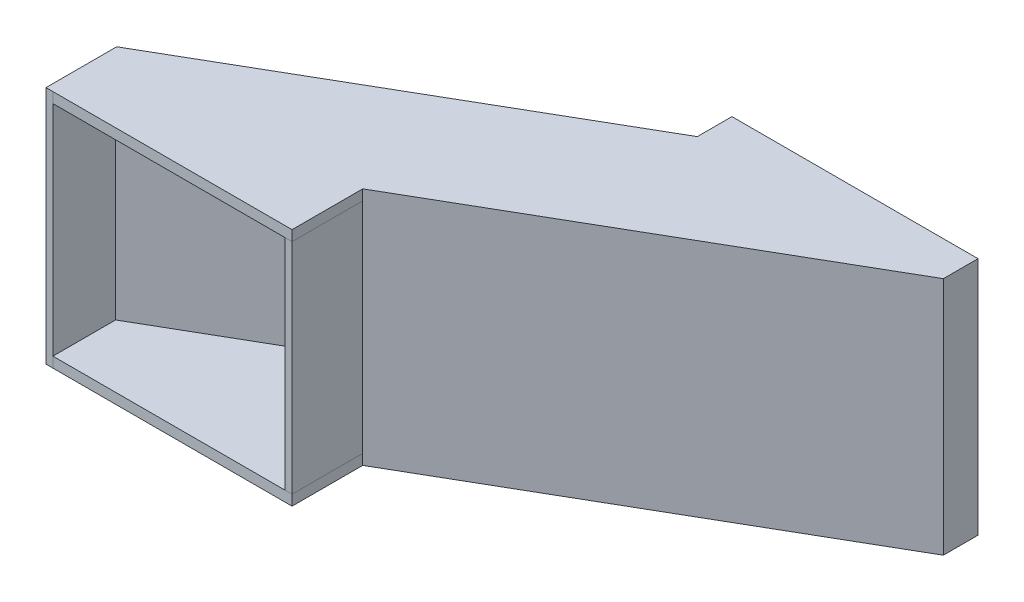
ISO-10303-21;
HEADER;
FILE_DESCRIPTION(('STEP AP214'),'2;1');
FILE_NAME('part.step','',(''),(''),'','','');
FILE_SCHEMA(('AUTOMOTIVE_DESIGN { 1 0 10303 214 1 1 1 1 }'));
ENDSEC;
DATA;
#1=APPLICATION_CONTEXT('core data for automotive mechanical design processes');
#2=APPLICATION_PROTOCOL_DEFINITION('international standard','automotive_design',2000,#1);
#3=PRODUCT_CONTEXT('',#1,'mechanical');
#4=PRODUCT('Part','Part','',(#3));
#5=PRODUCT_RELATED_PRODUCT_CATEGORY('part','',(#4));
#6=PRODUCT_DEFINITION_FORMATION('','',#4);
#7=PRODUCT_DEFINITION_CONTEXT('part definition',#1,'design');
#8=PRODUCT_DEFINITION('design','',#6,#7);
#9=PRODUCT_DEFINITION_SHAPE('','',#8);
#10=(LENGTH_UNIT() NAMED_UNIT(*) SI_UNIT(.MILLI.,.METRE.));
#11=(NAMED_UNIT(*) PLANE_ANGLE_UNIT() SI_UNIT($,.RADIAN.));
#12=(NAMED_UNIT(*) SI_UNIT($,.STERADIAN.) SOLID_ANGLE_UNIT());
#13=UNCERTAINTY_MEASURE_WITH_UNIT(LENGTH_MEASURE(1.E-05),#10,'distance_accuracy_value','');
#14=(GEOMETRIC_REPRESENTATION_CONTEXT(3) GLOBAL_UNCERTAINTY_ASSIGNED_CONTEXT((#13)) GLOBAL_UNIT_ASSIGNED_CONTEXT((#10,
#11,#12)) REPRESENTATION_CONTEXT('',''));
#15=CARTESIAN_POINT('',(0.,0.,0.));
#16=DIRECTION('',(0.,0.,1.));
#17=DIRECTION('',(1.,0.,0.));
#18=AXIS2_PLACEMENT_3D('',#15,#16,#17);
#19=CARTESIAN_POINT('',(-139.815929778168,34.5799191610907,91.7730554654798));
#20=DIRECTION('',(0.,1.,0.));
#21=DIRECTION('',(-1.,0.,0.));
#22=AXIS2_PLACEMENT_3D('',#19,#20,#21);
#23=PLANE('',#22);
#24=DIRECTION('',(9.88342315044595E-06,0.,-0.999999999951159));
#25=VECTOR('',#24,1.);
#26=CARTESIAN_POINT('',(-141.81592977807,34.5799191610907,91.7730356986335));
#27=LINE('',#26,#25);
#28=CARTESIAN_POINT('',(-141.81592977807,34.5799191610907,91.7730356986335));
#29=VERTEX_POINT('',#28);
#30=CARTESIAN_POINT('',(-141.815728098693,34.5799191610907,71.3672133594261));
#31=VERTEX_POINT('',#30);
#32=EDGE_CURVE('E112',#29,#31,#27,.T.);
#33=ORIENTED_EDGE('',*,*,#32,.F.);
#34=DIRECTION('',(-0.999999999951159,0.,-9.88342315044596E-06));
#35=VECTOR('',#34,1.);
#36=CARTESIAN_POINT('',(-139.815929778168,34.5799191610907,91.7730554654798));
#37=LINE('',#36,#35);
#38=CARTESIAN_POINT('',(-139.815929778168,34.5799191610907,91.7730554654798));
#39=VERTEX_POINT('',#38);
#40=EDGE_CURVE('E12',#39,#29,#37,.T.);
#41=ORIENTED_EDGE('',*,*,#40,.F.);
#42=DIRECTION('',(9.88342315044595E-06,0.,-0.999999999951159));
#43=VECTOR('',#42,1.);
#44=CARTESIAN_POINT('',(-139.815929778168,34.5799191610907,91.7730554654798));
#45=LINE('',#44,#43);
#46=CARTESIAN_POINT('',(-139.815728098791,34.5799191610907,71.3672331262724));
#47=VERTEX_POINT('',#46);
#48=EDGE_CURVE('E106',#39,#47,#45,.T.);
#49=ORIENTED_EDGE('',*,*,#48,.T.);
#50=DIRECTION('',(-0.999999999951159,0.,-9.88342315044596E-06));
#51=VECTOR('',#50,1.);
#52=CARTESIAN_POINT('',(-139.815728098791,34.5799191610907,71.3672331262724));
#53=LINE('',#52,#51);
#54=EDGE_CURVE('E51',#47,#31,#53,.T.);
#55=ORIENTED_EDGE('',*,*,#54,.T.);
#56=EDGE_LOOP('',(#33,#41,#49,#55));
#57=FACE_BOUND('',#56,.T.);
#58=ADVANCED_FACE('F48',(#57),#23,.T.);
#59=CARTESIAN_POINT('',(-139.815929778168,-34.5799191610907,91.7730554654798));
#60=DIRECTION('',(-9.88342315044596E-06,0.,0.999999999951159));
#61=DIRECTION('',(0.999999999951159,0.,9.88342315044596E-06));
#62=AXIS2_PLACEMENT_3D('',#59,#60,#61);
#63=PLANE('',#62);
#64=DIRECTION('',(0.,1.,0.));
#65=VECTOR('',#64,1.);
#66=CARTESIAN_POINT('',(-141.81592977807,-34.5799191610907,91.7730356986335));
#67=LINE('',#66,#65);
#68=CARTESIAN_POINT('',(-141.81592977807,-34.5799191610907,91.7730356986335));
#69=VERTEX_POINT('',#68);
#70=EDGE_CURVE('E108',#69,#29,#67,.T.);
#71=ORIENTED_EDGE('',*,*,#70,.F.);
#72=DIRECTION('',(-0.999999999951159,0.,-9.88342315044596E-06));
#73=VECTOR('',#72,1.);
#74=CARTESIAN_POINT('',(-139.815929778168,-34.5799191610907,91.7730554654798));
#75=LINE('',#74,#73);
#76=CARTESIAN_POINT('',(-139.815929778168,-34.5799191610907,91.7730554654798));
#77=VERTEX_POINT('',#76);
#78=EDGE_CURVE('E57',#77,#69,#75,.T.);
#79=ORIENTED_EDGE('',*,*,#78,.F.);
#80=DIRECTION('',(0.,1.,0.));
#81=VECTOR('',#80,1.);
#82=CARTESIAN_POINT('',(-139.815929778168,-34.5799191610907,91.7730554654798));
#83=LINE('',#82,#81);
#84=EDGE_CURVE('E103',#77,#39,#83,.T.);
#85=ORIENTED_EDGE('',*,*,#84,.T.);
#86=ORIENTED_EDGE('',*,*,#40,.T.);
#87=EDGE_LOOP('',(#71,#79,#85,#86));
#88=FACE_BOUND('',#87,.T.);
#89=ADVANCED_FACE('F122',(#88),#63,.T.);
#90=CARTESIAN_POINT('',(-139.815728098791,-34.5799191610907,71.3672331262724));
#91=DIRECTION('',(0.,-1.,0.));
#92=DIRECTION('',(1.,0.,0.));
#93=AXIS2_PLACEMENT_3D('',#90,#91,#92);
#94=PLANE('',#93);
#95=DIRECTION('',(-9.88342315044595E-06,0.,0.999999999951159));
#96=VECTOR('',#95,1.);
#97=CARTESIAN_POINT('',(-141.815728098693,-34.5799191610907,71.3672133594261));
#98=LINE('',#97,#96);
#99=CARTESIAN_POINT('',(-141.815728098693,-34.5799191610907,71.3672133594261));
#100=VERTEX_POINT('',#99);
#101=EDGE_CURVE('E98',#100,#69,#98,.T.);
#102=ORIENTED_EDGE('',*,*,#101,.F.);
#103=DIRECTION('',(-0.999999999951159,0.,-9.88342315044596E-06));
#104=VECTOR('',#103,1.);
#105=CARTESIAN_POINT('',(-139.815728098791,-34.5799191610907,71.3672331262724));
#106=LINE('',#105,#104);
#107=CARTESIAN_POINT('',(-139.815728098791,-34.5799191610907,71.3672331262724));
#108=VERTEX_POINT('',#107);
#109=EDGE_CURVE('E93',#108,#100,#106,.T.);
#110=ORIENTED_EDGE('',*,*,#109,.F.);
#111=DIRECTION('',(-9.88342315044595E-06,0.,0.999999999951159));
#112=VECTOR('',#111,1.);
#113=CARTESIAN_POINT('',(-139.815728098791,-34.5799191610907,71.3672331262724));
#114=LINE('',#113,#112);
#115=EDGE_CURVE('E96',#108,#77,#114,.T.);
#116=ORIENTED_EDGE('',*,*,#115,.T.);
#117=ORIENTED_EDGE('',*,*,#78,.T.);
#118=EDGE_LOOP('',(#102,#110,#116,#117));
#119=FACE_BOUND('',#118,.T.);
#120=ADVANCED_FACE('F95',(#119),#94,.T.);
#121=CARTESIAN_POINT('',(-139.815728098791,34.5799191610907,71.3672331262724));
#122=DIRECTION('',(9.88342315044596E-06,0.,-0.999999999951159));
#123=DIRECTION('',(-0.999999999951159,0.,-9.88342315044596E-06));
#124=AXIS2_PLACEMENT_3D('',#121,#122,#123);
#125=PLANE('',#124);
#126=DIRECTION('',(0.,-1.,0.));
#127=VECTOR('',#126,1.);
#128=CARTESIAN_POINT('',(-141.815728098693,34.5799191610907,71.3672133594261));
#129=LINE('',#128,#127);
#130=EDGE_CURVE('E115',#31,#100,#129,.T.);
#131=ORIENTED_EDGE('',*,*,#130,.F.);
#132=ORIENTED_EDGE('',*,*,#54,.F.);
#133=DIRECTION('',(0.,-1.,0.));
#134=VECTOR('',#133,1.);
#135=CARTESIAN_POINT('',(-139.815728098791,34.5799191610907,71.3672331262724));
#136=LINE('',#135,#134);
#137=EDGE_CURVE('E102',#47,#108,#136,.T.);
#138=ORIENTED_EDGE('',*,*,#137,.T.);
#139=ORIENTED_EDGE('',*,*,#109,.T.);
#140=EDGE_LOOP('',(#131,#132,#138,#139));
#141=FACE_BOUND('',#140,.T.);
#142=ADVANCED_FACE('F105',(#141),#125,.T.);
#143=CARTESIAN_POINT('',(-139.815022732569,0.,-0.00138185103252269));
#144=DIRECTION('',(-0.999999999951159,0.,-9.88342315044595E-06));
#145=DIRECTION('',(-9.88342315044595E-06,0.,0.999999999951159));
#146=AXIS2_PLACEMENT_3D('',#143,#144,#145);
#147=PLANE('',#146);
#148=ORIENTED_EDGE('',*,*,#48,.F.);
#149=ORIENTED_EDGE('',*,*,#84,.F.);
#150=ORIENTED_EDGE('',*,*,#115,.F.);
#151=ORIENTED_EDGE('',*,*,#137,.F.);
#152=EDGE_LOOP('',(#148,#149,#150,#151));
#153=FACE_BOUND('',#152,.T.);
#154=ADVANCED_FACE('F101',(#153),#147,.F.);
#155=CARTESIAN_POINT('',(-141.815022732472,0.,-0.00140161787882359));
#156=DIRECTION('',(-0.999999999951159,0.,-9.88342315044595E-06));
#157=DIRECTION('',(-9.88342315044595E-06,0.,0.999999999951159));
#158=AXIS2_PLACEMENT_3D('',#155,#156,#157);
#159=PLANE('',#158);
#160=ORIENTED_EDGE('',*,*,#32,.T.);
#161=ORIENTED_EDGE('',*,*,#130,.T.);
#162=ORIENTED_EDGE('',*,*,#101,.T.);
#163=ORIENTED_EDGE('',*,*,#70,.T.);
#164=EDGE_LOOP('',(#160,#161,#162,#163));
#165=FACE_BOUND('',#164,.T.);
#166=ADVANCED_FACE('F121',(#165),#159,.T.);
#167=CLOSED_SHELL('',(#58,#89,#120,#142,#154,#166));
#168=MANIFOLD_SOLID_BREP('B2',#167);
#169=CARTESIAN_POINT('',(-72.7659297780701,31.5799191610907,91.7730356986335));
#170=DIRECTION('',(0.,1.,0.));
#171=DIRECTION('',(-1.,0.,0.));
#172=AXIS2_PLACEMENT_3D('',#169,#170,#171);
#173=PLANE('',#172);
#174=DIRECTION('',(0.,0.,1.));
#175=VECTOR('',#174,1.);
#176=CARTESIAN_POINT('',(-70.7659297780701,31.5799191610907,91.7730356986335));
#177=LINE('',#176,#175);
#178=CARTESIAN_POINT('',(-70.7659297780701,31.5799191610907,71.3668640404984));
#179=VERTEX_POINT('',#178);
#180=CARTESIAN_POINT('',(-70.7659297780701,31.5799191610907,91.7730356986335));
#181=VERTEX_POINT('',#180);
#182=EDGE_CURVE('E258',#179,#181,#177,.T.);
#183=ORIENTED_EDGE('',*,*,#182,.F.);
#184=DIRECTION('',(1.,0.,0.));
#185=VECTOR('',#184,1.);
#186=CARTESIAN_POINT('',(-72.7659297780701,31.5799191610907,71.3668640404984));
#187=LINE('',#186,#185);
#188=CARTESIAN_POINT('',(-72.7659297780701,31.5799191610907,71.3668640404984));
#189=VERTEX_POINT('',#188);
#190=EDGE_CURVE('E46',#189,#179,#187,.T.);
#191=ORIENTED_EDGE('',*,*,#190,.F.);
#192=DIRECTION('',(0.,0.,1.));
#193=VECTOR('',#192,1.);
#194=CARTESIAN_POINT('',(-72.7659297780701,31.5799191610907,91.7730356986335));
#195=LINE('',#194,#193);
#196=CARTESIAN_POINT('',(-72.7659297780701,31.5799191610907,91.7730356986335));
#197=VERTEX_POINT('',#196);
#198=EDGE_CURVE('E252',#189,#197,#195,.T.);
#199=ORIENTED_EDGE('',*,*,#198,.T.);
#200=DIRECTION('',(1.,0.,0.));
#201=VECTOR('',#200,1.);
#202=CARTESIAN_POINT('',(-72.7659297780701,31.5799191610907,91.7730356986335));
#203=LINE('',#202,#201);
#204=EDGE_CURVE('E197',#197,#181,#203,.T.);
#205=ORIENTED_EDGE('',*,*,#204,.T.);
#206=EDGE_LOOP('',(#183,#191,#199,#205));
#207=FACE_BOUND('',#206,.T.);
#208=ADVANCED_FACE('F194',(#207),#173,.T.);
#209=CARTESIAN_POINT('',(-72.7659297780701,31.5799191610907,71.3668640404984));
#210=DIRECTION('',(0.,0.,-1.));
#211=DIRECTION('',(-1.,0.,0.));
#212=AXIS2_PLACEMENT_3D('',#209,#210,#211);
#213=PLANE('',#212);
#214=DIRECTION('',(0.,1.,0.));
#215=VECTOR('',#214,1.);
#216=CARTESIAN_POINT('',(-70.7659297780701,31.5799191610907,71.3668640404984));
#217=LINE('',#216,#215);
#218=CARTESIAN_POINT('',(-70.7659297780701,-31.5799191610907,71.3668640404984));
#219=VERTEX_POINT('',#218);
#220=EDGE_CURVE('E254',#219,#179,#217,.T.);
#221=ORIENTED_EDGE('',*,*,#220,.F.);
#222=DIRECTION('',(1.,0.,0.));
#223=VECTOR('',#222,1.);
#224=CARTESIAN_POINT('',(-72.7659297780701,-31.5799191610907,71.3668640404984));
#225=LINE('',#224,#223);
#226=CARTESIAN_POINT('',(-72.7659297780701,-31.5799191610907,71.3668640404984));
#227=VERTEX_POINT('',#226);
#228=EDGE_CURVE('E203',#227,#219,#225,.T.);
#229=ORIENTED_EDGE('',*,*,#228,.F.);
#230=DIRECTION('',(0.,1.,0.));
#231=VECTOR('',#230,1.);
#232=CARTESIAN_POINT('',(-72.7659297780701,31.5799191610907,71.3668640404984));
#233=LINE('',#232,#231);
#234=EDGE_CURVE('E249',#227,#189,#233,.T.);
#235=ORIENTED_EDGE('',*,*,#234,.T.);
#236=ORIENTED_EDGE('',*,*,#190,.T.);
#237=EDGE_LOOP('',(#221,#229,#235,#236));
#238=FACE_BOUND('',#237,.T.);
#239=ADVANCED_FACE('F268',(#238),#213,.T.);
#240=CARTESIAN_POINT('',(-72.7659297780701,-31.5799191610907,91.7730356986335));
#241=DIRECTION('',(0.,-1.,0.));
#242=DIRECTION('',(1.,0.,0.));
#243=AXIS2_PLACEMENT_3D('',#240,#241,#242);
#244=PLANE('',#243);
#245=DIRECTION('',(0.,0.,-1.));
#246=VECTOR('',#245,1.);
#247=CARTESIAN_POINT('',(-70.7659297780701,-31.5799191610907,91.7730356986335));
#248=LINE('',#247,#246);
#249=CARTESIAN_POINT('',(-70.7659297780701,-31.5799191610907,91.7730356986335));
#250=VERTEX_POINT('',#249);
#251=EDGE_CURVE('E244',#250,#219,#248,.T.);
#252=ORIENTED_EDGE('',*,*,#251,.F.);
#253=DIRECTION('',(1.,0.,0.));
#254=VECTOR('',#253,1.);
#255=CARTESIAN_POINT('',(-72.7659297780701,-31.5799191610907,91.7730356986335));
#256=LINE('',#255,#254);
#257=CARTESIAN_POINT('',(-72.7659297780701,-31.5799191610907,91.7730356986335));
#258=VERTEX_POINT('',#257);
#259=EDGE_CURVE('E239',#258,#250,#256,.T.);
#260=ORIENTED_EDGE('',*,*,#259,.F.);
#261=DIRECTION('',(0.,0.,-1.));
#262=VECTOR('',#261,1.);
#263=CARTESIAN_POINT('',(-72.7659297780701,-31.5799191610907,91.7730356986335));
#264=LINE('',#263,#262);
#265=EDGE_CURVE('E242',#258,#227,#264,.T.);
#266=ORIENTED_EDGE('',*,*,#265,.T.);
#267=ORIENTED_EDGE('',*,*,#228,.T.);
#268=EDGE_LOOP('',(#252,#260,#266,#267));
#269=FACE_BOUND('',#268,.T.);
#270=ADVANCED_FACE('F241',(#269),#244,.T.);
#271=CARTESIAN_POINT('',(-72.7659297780701,-31.5799191610907,91.7730356986335));
#272=DIRECTION('',(0.,0.,1.));
#273=DIRECTION('',(1.,0.,0.));
#274=AXIS2_PLACEMENT_3D('',#271,#272,#273);
#275=PLANE('',#274);
#276=DIRECTION('',(0.,-1.,0.));
#277=VECTOR('',#276,1.);
#278=CARTESIAN_POINT('',(-70.7659297780701,-31.5799191610907,91.7730356986335));
#279=LINE('',#278,#277);
#280=EDGE_CURVE('E261',#181,#250,#279,.T.);
#281=ORIENTED_EDGE('',*,*,#280,.F.);
#282=ORIENTED_EDGE('',*,*,#204,.F.);
#283=DIRECTION('',(0.,-1.,0.));
#284=VECTOR('',#283,1.);
#285=CARTESIAN_POINT('',(-72.7659297780701,-31.5799191610907,91.7730356986335));
#286=LINE('',#285,#284);
#287=EDGE_CURVE('E248',#197,#258,#286,.T.);
#288=ORIENTED_EDGE('',*,*,#287,.T.);
#289=ORIENTED_EDGE('',*,*,#259,.T.);
#290=EDGE_LOOP('',(#281,#282,#288,#289));
#291=FACE_BOUND('',#290,.T.);
#292=ADVANCED_FACE('F251',(#291),#275,.T.);
#293=CARTESIAN_POINT('',(-72.7659297780701,0.,0.));
#294=DIRECTION('',(-1.,0.,0.));
#295=DIRECTION('',(0.,0.,1.));
#296=AXIS2_PLACEMENT_3D('',#293,#294,#295);
#297=PLANE('',#296);
#298=ORIENTED_EDGE('',*,*,#198,.F.);
#299=ORIENTED_EDGE('',*,*,#234,.F.);
#300=ORIENTED_EDGE('',*,*,#265,.F.);
#301=ORIENTED_EDGE('',*,*,#287,.F.);
#302=EDGE_LOOP('',(#298,#299,#300,#301));
#303=FACE_BOUND('',#302,.T.);
#304=ADVANCED_FACE('F247',(#303),#297,.T.);
#305=CARTESIAN_POINT('',(-70.7659297780701,0.,0.));
#306=DIRECTION('',(-1.,0.,0.));
#307=DIRECTION('',(0.,0.,1.));
#308=AXIS2_PLACEMENT_3D('',#305,#306,#307);
#309=PLANE('',#308);
#310=ORIENTED_EDGE('',*,*,#182,.T.);
#311=ORIENTED_EDGE('',*,*,#280,.T.);
#312=ORIENTED_EDGE('',*,*,#251,.T.);
#313=ORIENTED_EDGE('',*,*,#220,.T.);
#314=EDGE_LOOP('',(#310,#311,#312,#313));
#315=FACE_BOUND('',#314,.T.);
#316=ADVANCED_FACE('F267',(#315),#309,.F.);
#317=CLOSED_SHELL('',(#208,#239,#270,#292,#304,#316));
#318=MANIFOLD_SOLID_BREP('B6',#317);
#319=CARTESIAN_POINT('',(-140.315728098693,31.5799191610907,73.9652895707794));
#320=DIRECTION('',(-0.866025403784442,0.,0.499999999999995));
#321=DIRECTION('',(0.499999999999995,0.,0.866025403784442));
#322=AXIS2_PLACEMENT_3D('',#319,#320,#321);
#323=PLANE('',#322);
#324=DIRECTION('',(0.,1.,0.));
#325=VECTOR('',#324,1.);
#326=CARTESIAN_POINT('',(-141.815728098693,31.5799191610907,71.3672133594261));
#327=LINE('',#326,#325);
#328=CARTESIAN_POINT('',(-141.815728098693,-31.5799191610907,71.3672133594261));
#329=VERTEX_POINT('',#328);
#330=CARTESIAN_POINT('',(-141.815728098693,31.5799191610907,71.3672133594261));
#331=VERTEX_POINT('',#330);
#332=EDGE_CURVE('E403',#329,#331,#327,.T.);
#333=ORIENTED_EDGE('',*,*,#332,.F.);
#334=DIRECTION('',(-0.499999999999995,0.,-0.866025403784442));
#335=VECTOR('',#334,1.);
#336=CARTESIAN_POINT('',(-140.315728098693,-31.5799191610907,73.9652895707794));
#337=LINE('',#336,#335);
#338=CARTESIAN_POINT('',(-140.315728098693,-31.5799191610907,73.9652895707794));
#339=VERTEX_POINT('',#338);
#340=EDGE_CURVE('E192',#339,#329,#337,.T.);
#341=ORIENTED_EDGE('',*,*,#340,.F.);
#342=DIRECTION('',(0.,1.,0.));
#343=VECTOR('',#342,1.);
#344=CARTESIAN_POINT('',(-140.315728098693,31.5799191610907,73.9652895707794));
#345=LINE('',#344,#343);
#346=CARTESIAN_POINT('',(-140.315728098693,31.5799191610907,73.9652895707794));
#347=VERTEX_POINT('',#346);
#348=EDGE_CURVE('E397',#339,#347,#345,.T.);
#349=ORIENTED_EDGE('',*,*,#348,.T.);
#350=DIRECTION('',(-0.499999999999995,0.,-0.866025403784442));
#351=VECTOR('',#350,1.);
#352=CARTESIAN_POINT('',(-140.315728098693,31.5799191610907,73.9652895707794));
#353=LINE('',#352,#351);
#354=EDGE_CURVE('E342',#347,#331,#353,.T.);
#355=ORIENTED_EDGE('',*,*,#354,.T.);
#356=EDGE_LOOP('',(#333,#341,#349,#355));
#357=FACE_BOUND('',#356,.T.);
#358=ADVANCED_FACE('F339',(#357),#323,.T.);
#359=CARTESIAN_POINT('',(-34.0245966412461,-31.5799191610907,12.5980762113533));
#360=DIRECTION('',(0.,-1.,0.));
#361=DIRECTION('',(0.,0.,-1.));
#362=AXIS2_PLACEMENT_3D('',#359,#360,#361);
#363=PLANE('',#362);
#364=DIRECTION('',(-0.866025403784442,0.,0.499999999999995));
#365=VECTOR('',#364,1.);
#366=CARTESIAN_POINT('',(-35.5245966412461,-31.5799191610907,9.99999999999999));
#367=LINE('',#366,#365);
#368=CARTESIAN_POINT('',(-35.5245966412461,-31.5799191610907,9.99999999999999));
#369=VERTEX_POINT('',#368);
#370=EDGE_CURVE('E399',#369,#329,#367,.T.);
#371=ORIENTED_EDGE('',*,*,#370,.F.);
#372=DIRECTION('',(-0.499999999999995,0.,-0.866025403784442));
#373=VECTOR('',#372,1.);
#374=CARTESIAN_POINT('',(-34.0245966412461,-31.5799191610907,12.5980762113533));
#375=LINE('',#374,#373);
#376=CARTESIAN_POINT('',(-34.0245966412461,-31.5799191610907,12.5980762113533));
#377=VERTEX_POINT('',#376);
#378=EDGE_CURVE('E348',#377,#369,#375,.T.);
#379=ORIENTED_EDGE('',*,*,#378,.F.);
#380=DIRECTION('',(-0.866025403784442,0.,0.499999999999995));
#381=VECTOR('',#380,1.);
#382=CARTESIAN_POINT('',(-34.0245966412461,-31.5799191610907,12.5980762113533));
#383=LINE('',#382,#381);
#384=EDGE_CURVE('E394',#377,#339,#383,.T.);
#385=ORIENTED_EDGE('',*,*,#384,.T.);
#386=ORIENTED_EDGE('',*,*,#340,.T.);
#387=EDGE_LOOP('',(#371,#379,#385,#386));
#388=FACE_BOUND('',#387,.T.);
#389=ADVANCED_FACE('F413',(#388),#363,.T.);
#390=CARTESIAN_POINT('',(-34.0245966412461,31.5799191610907,12.5980762113533));
#391=DIRECTION('',(0.866025403784442,0.,-0.499999999999995));
#392=DIRECTION('',(-0.499999999999995,0.,-0.866025403784442));
#393=AXIS2_PLACEMENT_3D('',#390,#391,#392);
#394=PLANE('',#393);
#395=DIRECTION('',(0.,-1.,0.));
#396=VECTOR('',#395,1.);
#397=CARTESIAN_POINT('',(-35.5245966412461,31.5799191610907,10.));
#398=LINE('',#397,#396);
#399=CARTESIAN_POINT('',(-35.5245966412461,31.5799191610907,10.));
#400=VERTEX_POINT('',#399);
#401=EDGE_CURVE('E389',#400,#369,#398,.T.);
#402=ORIENTED_EDGE('',*,*,#401,.F.);
#403=DIRECTION('',(-0.499999999999995,0.,-0.866025403784442));
#404=VECTOR('',#403,1.);
#405=CARTESIAN_POINT('',(-34.0245966412461,31.5799191610907,12.5980762113533));
#406=LINE('',#405,#404);
#407=CARTESIAN_POINT('',(-34.0245966412461,31.5799191610907,12.5980762113533));
#408=VERTEX_POINT('',#407);
#409=EDGE_CURVE('E384',#408,#400,#406,.T.);
#410=ORIENTED_EDGE('',*,*,#409,.F.);
#411=DIRECTION('',(0.,-1.,0.));
#412=VECTOR('',#411,1.);
#413=CARTESIAN_POINT('',(-34.0245966412461,31.5799191610907,12.5980762113533));
#414=LINE('',#413,#412);
#415=EDGE_CURVE('E387',#408,#377,#414,.T.);
#416=ORIENTED_EDGE('',*,*,#415,.T.);
#417=ORIENTED_EDGE('',*,*,#378,.T.);
#418=EDGE_LOOP('',(#402,#410,#416,#417));
#419=FACE_BOUND('',#418,.T.);
#420=ADVANCED_FACE('F386',(#419),#394,.T.);
#421=CARTESIAN_POINT('',(-34.0245966412461,31.5799191610907,12.5980762113533));
#422=DIRECTION('',(0.,1.,0.));
#423=DIRECTION('',(0.,0.,1.));
#424=AXIS2_PLACEMENT_3D('',#421,#422,#423);
#425=PLANE('',#424);
#426=DIRECTION('',(0.866025403784442,0.,-0.499999999999995));
#427=VECTOR('',#426,1.);
#428=CARTESIAN_POINT('',(-35.5245966412461,31.5799191610907,10.));
#429=LINE('',#428,#427);
#430=EDGE_CURVE('E406',#331,#400,#429,.T.);
#431=ORIENTED_EDGE('',*,*,#430,.F.);
#432=ORIENTED_EDGE('',*,*,#354,.F.);
#433=DIRECTION('',(0.866025403784442,0.,-0.499999999999995));
#434=VECTOR('',#433,1.);
#435=CARTESIAN_POINT('',(-34.0245966412461,31.5799191610907,12.5980762113533));
#436=LINE('',#435,#434);
#437=EDGE_CURVE('E393',#347,#408,#436,.T.);
#438=ORIENTED_EDGE('',*,*,#437,.T.);
#439=ORIENTED_EDGE('',*,*,#409,.T.);
#440=EDGE_LOOP('',(#431,#432,#438,#439));
#441=FACE_BOUND('',#440,.T.);
#442=ADVANCED_FACE('F396',(#441),#425,.T.);
#443=CARTESIAN_POINT('',(-3.0510221413892,0.,-5.28452536390376));
#444=DIRECTION('',(-0.499999999999995,0.,-0.866025403784442));
#445=DIRECTION('',(-0.866025403784442,0.,0.499999999999995));
#446=AXIS2_PLACEMENT_3D('',#443,#444,#445);
#447=PLANE('',#446);
#448=ORIENTED_EDGE('',*,*,#348,.F.);
#449=ORIENTED_EDGE('',*,*,#384,.F.);
#450=ORIENTED_EDGE('',*,*,#415,.F.);
#451=ORIENTED_EDGE('',*,*,#437,.F.);
#452=EDGE_LOOP('',(#448,#449,#450,#451));
#453=FACE_BOUND('',#452,.T.);
#454=ADVANCED_FACE('F392',(#453),#447,.F.);
#455=CARTESIAN_POINT('',(-4.55102214138918,0.,-7.88260157525708));
#456=DIRECTION('',(-0.499999999999995,0.,-0.866025403784442));
#457=DIRECTION('',(-0.866025403784442,0.,0.499999999999995));
#458=AXIS2_PLACEMENT_3D('',#455,#456,#457);
#459=PLANE('',#458);
#460=ORIENTED_EDGE('',*,*,#332,.T.);
#461=ORIENTED_EDGE('',*,*,#430,.T.);
#462=ORIENTED_EDGE('',*,*,#401,.T.);
#463=ORIENTED_EDGE('',*,*,#370,.T.);
#464=EDGE_LOOP('',(#460,#461,#462,#463));
#465=FACE_BOUND('',#464,.T.);
#466=ADVANCED_FACE('F412',(#465),#459,.T.);
#467=CLOSED_SHELL('',(#358,#389,#420,#442,#454,#466));
#468=MANIFOLD_SOLID_BREP('B40',#467);
#469=CARTESIAN_POINT('',(0.,0.,10.));
#470=DIRECTION('',(0.,0.,1.));
#471=DIRECTION('',(1.,0.,0.));
#472=AXIS2_PLACEMENT_3D('',#469,#470,#471);
#473=PLANE('',#472);
#474=DIRECTION('',(-1.,0.,0.));
#475=VECTOR('',#474,1.);
#476=CARTESIAN_POINT('',(35.5245966412461,31.5799191610907,10.));
#477=LINE('',#476,#475);
#478=CARTESIAN_POINT('',(-32.5245966412461,31.5799191610907,10.));
#479=VERTEX_POINT('',#478);
#480=CARTESIAN_POINT('',(-35.5245966412461,31.5799191610907,10.));
#481=VERTEX_POINT('',#480);
#482=EDGE_CURVE('E629',#479,#481,#477,.T.);
#483=ORIENTED_EDGE('',*,*,#482,.T.);
#484=DIRECTION('',(0.,-1.,0.));
#485=VECTOR('',#484,1.);
#486=CARTESIAN_POINT('',(-35.5245966412461,34.5799191610907,10.));
#487=LINE('',#486,#485);
#488=CARTESIAN_POINT('',(-35.5245966412461,-31.5799191610907,9.99999999999999));
#489=VERTEX_POINT('',#488);
#490=EDGE_CURVE('E709',#481,#489,#487,.T.);
#491=ORIENTED_EDGE('',*,*,#490,.T.);
#492=DIRECTION('',(1.,0.,0.));
#493=VECTOR('',#492,1.);
#494=CARTESIAN_POINT('',(-35.5245966412461,-31.5799191610907,10.));
#495=LINE('',#494,#493);
#496=CARTESIAN_POINT('',(-32.5245966412461,-31.5799191610907,10.));
#497=VERTEX_POINT('',#496);
#498=EDGE_CURVE('E664',#489,#497,#495,.T.);
#499=ORIENTED_EDGE('',*,*,#498,.T.);
#500=DIRECTION('',(0.,-1.,0.));
#501=VECTOR('',#500,1.);
#502=CARTESIAN_POINT('',(-32.5245966412461,31.5799191610907,10.));
#503=LINE('',#502,#501);
#504=EDGE_CURVE('E688',#479,#497,#503,.T.);
#505=ORIENTED_EDGE('',*,*,#504,.F.);
#506=EDGE_LOOP('',(#483,#491,#499,#505));
#507=FACE_BOUND('',#506,.T.);
#508=ADVANCED_FACE('F463',(#507),#473,.T.);
#509=CARTESIAN_POINT('',(0.,0.,0.));
#510=DIRECTION('',(0.,0.,1.));
#511=DIRECTION('',(1.,0.,0.));
#512=AXIS2_PLACEMENT_3D('',#509,#510,#511);
#513=PLANE('',#512);
#514=DIRECTION('',(0.,-1.,0.));
#515=VECTOR('',#514,1.);
#516=CARTESIAN_POINT('',(-35.5245966412461,34.5799191610907,0.));
#517=LINE('',#516,#515);
#518=CARTESIAN_POINT('',(-35.5245966412461,34.5799191610907,0.));
#519=VERTEX_POINT('',#518);
#520=CARTESIAN_POINT('',(-35.5245966412461,-34.5799191610907,0.));
#521=VERTEX_POINT('',#520);
#522=EDGE_CURVE('E704',#519,#521,#517,.T.);
#523=ORIENTED_EDGE('',*,*,#522,.F.);
#524=DIRECTION('',(-1.,0.,0.));
#525=VECTOR('',#524,1.);
#526=CARTESIAN_POINT('',(-35.5245966412461,34.5799191610907,0.));
#527=LINE('',#526,#525);
#528=CARTESIAN_POINT('',(35.5245966412462,34.5799191610907,0.));
#529=VERTEX_POINT('',#528);
#530=EDGE_CURVE('E718',#529,#519,#527,.T.);
#531=ORIENTED_EDGE('',*,*,#530,.F.);
#532=DIRECTION('',(0.,1.,0.));
#533=VECTOR('',#532,1.);
#534=CARTESIAN_POINT('',(35.5245966412462,34.5799191610907,0.));
#535=LINE('',#534,#533);
#536=CARTESIAN_POINT('',(35.5245966412462,-34.5799191610907,0.));
#537=VERTEX_POINT('',#536);
#538=EDGE_CURVE('E716',#537,#529,#535,.T.);
#539=ORIENTED_EDGE('',*,*,#538,.F.);
#540=DIRECTION('',(1.,0.,0.));
#541=VECTOR('',#540,1.);
#542=CARTESIAN_POINT('',(-35.5245966412461,-34.5799191610907,0.));
#543=LINE('',#542,#541);
#544=EDGE_CURVE('E714',#521,#537,#543,.T.);
#545=ORIENTED_EDGE('',*,*,#544,.F.);
#546=EDGE_LOOP('',(#523,#531,#539,#545));
#547=FACE_BOUND('',#546,.T.);
#548=DIRECTION('',(-1.,0.,0.));
#549=VECTOR('',#548,1.);
#550=CARTESIAN_POINT('',(-32.5245966412461,31.5799191610907,0.));
#551=LINE('',#550,#549);
#552=CARTESIAN_POINT('',(32.5245966412462,31.5799191610907,0.));
#553=VERTEX_POINT('',#552);
#554=CARTESIAN_POINT('',(-32.5245966412461,31.5799191610907,0.));
#555=VERTEX_POINT('',#554);
#556=EDGE_CURVE('E666',#553,#555,#551,.T.);
#557=ORIENTED_EDGE('',*,*,#556,.T.);
#558=DIRECTION('',(0.,-1.,0.));
#559=VECTOR('',#558,1.);
#560=CARTESIAN_POINT('',(-32.5245966412461,31.5799191610907,0.));
#561=LINE('',#560,#559);
#562=CARTESIAN_POINT('',(-32.5245966412461,-31.5799191610907,0.));
#563=VERTEX_POINT('',#562);
#564=EDGE_CURVE('E693',#555,#563,#561,.T.);
#565=ORIENTED_EDGE('',*,*,#564,.T.);
#566=DIRECTION('',(1.,0.,0.));
#567=VECTOR('',#566,1.);
#568=CARTESIAN_POINT('',(-32.5245966412461,-31.5799191610907,0.));
#569=LINE('',#568,#567);
#570=CARTESIAN_POINT('',(32.5245966412462,-31.5799191610907,0.));
#571=VERTEX_POINT('',#570);
#572=EDGE_CURVE('E696',#563,#571,#569,.T.);
#573=ORIENTED_EDGE('',*,*,#572,.T.);
#574=DIRECTION('',(0.,1.,0.));
#575=VECTOR('',#574,1.);
#576=CARTESIAN_POINT('',(32.5245966412462,31.5799191610907,0.));
#577=LINE('',#576,#575);
#578=EDGE_CURVE('E592',#571,#553,#577,.T.);
#579=ORIENTED_EDGE('',*,*,#578,.T.);
#580=EDGE_LOOP('',(#557,#565,#573,#579));
#581=FACE_BOUND('',#580,.T.);
#582=ADVANCED_FACE('F740',(#547,#581),#513,.F.);
#583=CARTESIAN_POINT('',(-35.5245966412461,34.5799191610907,10.));
#584=DIRECTION('',(1.,0.,0.));
#585=DIRECTION('',(0.,0.,-1.));
#586=AXIS2_PLACEMENT_3D('',#583,#584,#585);
#587=PLANE('',#586);
#588=ORIENTED_EDGE('',*,*,#522,.T.);
#589=DIRECTION('',(0.,0.,-1.));
#590=VECTOR('',#589,1.);
#591=CARTESIAN_POINT('',(-35.5245966412461,-34.5799191610907,10.));
#592=LINE('',#591,#590);
#593=CARTESIAN_POINT('',(-35.5245966412461,-34.5799191610907,10.));
#594=VERTEX_POINT('',#593);
#595=EDGE_CURVE('E471',#594,#521,#592,.T.);
#596=ORIENTED_EDGE('',*,*,#595,.F.);
#597=DIRECTION('',(0.,-1.,0.));
#598=VECTOR('',#597,1.);
#599=CARTESIAN_POINT('',(-35.5245966412461,163.705747691472,10.));
#600=LINE('',#599,#598);
#601=EDGE_CURVE('E667',#489,#594,#600,.T.);
#602=ORIENTED_EDGE('',*,*,#601,.F.);
#603=ORIENTED_EDGE('',*,*,#490,.F.);
#604=CARTESIAN_POINT('',(-35.5245966412461,34.5799191610907,10.));
#605=VERTEX_POINT('',#604);
#606=EDGE_CURVE('E705',#605,#481,#487,.T.);
#607=ORIENTED_EDGE('',*,*,#606,.F.);
#608=DIRECTION('',(0.,0.,-1.));
#609=VECTOR('',#608,1.);
#610=CARTESIAN_POINT('',(-35.5245966412461,34.5799191610907,10.));
#611=LINE('',#610,#609);
#612=EDGE_CURVE('E711',#605,#519,#611,.T.);
#613=ORIENTED_EDGE('',*,*,#612,.T.);
#614=EDGE_LOOP('',(#588,#596,#602,#603,#607,#613));
#615=FACE_BOUND('',#614,.T.);
#616=ADVANCED_FACE('F465',(#615),#587,.F.);
#617=CARTESIAN_POINT('',(-35.5245966412461,-34.5799191610907,10.));
#618=DIRECTION('',(0.,1.,0.));
#619=DIRECTION('',(-1.,0.,0.));
#620=AXIS2_PLACEMENT_3D('',#617,#618,#619);
#621=PLANE('',#620);
#622=DIRECTION('',(-0.866025403784442,0.,0.499999999999995));
#623=VECTOR('',#622,1.);
#624=CARTESIAN_POINT('',(35.5245966412462,-34.5799191610907,10.));
#625=LINE('',#624,#623);
#626=CARTESIAN_POINT('',(35.5245966412462,-34.5799191610907,10.));
#627=VERTEX_POINT('',#626);
#628=CARTESIAN_POINT('',(-70.7659297780701,-34.5799191610907,71.3668640404984));
#629=VERTEX_POINT('',#628);
#630=EDGE_CURVE('E632',#627,#629,#625,.T.);
#631=ORIENTED_EDGE('',*,*,#630,.T.);
#632=DIRECTION('',(0.,0.,1.));
#633=VECTOR('',#632,1.);
#634=CARTESIAN_POINT('',(-70.7659297780701,-34.5799191610907,71.3668640404984));
#635=LINE('',#634,#633);
#636=CARTESIAN_POINT('',(-70.7659297780701,-34.5799191610907,91.7730356986335));
#637=VERTEX_POINT('',#636);
#638=EDGE_CURVE('E659',#629,#637,#635,.T.);
#639=ORIENTED_EDGE('',*,*,#638,.T.);
#640=DIRECTION('',(-1.,0.,0.));
#641=VECTOR('',#640,1.);
#642=CARTESIAN_POINT('',(-70.7659297780701,-34.5799191610907,91.7730356986335));
#643=LINE('',#642,#641);
#644=CARTESIAN_POINT('',(-141.81592977807,-34.5799191610907,91.7730356986335));
#645=VERTEX_POINT('',#644);
#646=EDGE_CURVE('E656',#637,#645,#643,.T.);
#647=ORIENTED_EDGE('',*,*,#646,.T.);
#648=DIRECTION('',(9.88342315044596E-06,0.,-0.999999999951159));
#649=VECTOR('',#648,1.);
#650=CARTESIAN_POINT('',(-141.815728098693,-34.5799191610907,71.3672133594261));
#651=LINE('',#650,#649);
#652=CARTESIAN_POINT('',(-141.815728098693,-34.5799191610907,71.3672133594261));
#653=VERTEX_POINT('',#652);
#654=EDGE_CURVE('E653',#645,#653,#651,.T.);
#655=ORIENTED_EDGE('',*,*,#654,.T.);
#656=DIRECTION('',(0.866025403784442,0.,-0.499999999999995));
#657=VECTOR('',#656,1.);
#658=CARTESIAN_POINT('',(-35.5245966412461,-34.5799191610907,10.));
#659=LINE('',#658,#657);
#660=EDGE_CURVE('E649',#653,#594,#659,.T.);
#661=ORIENTED_EDGE('',*,*,#660,.T.);
#662=ORIENTED_EDGE('',*,*,#595,.T.);
#663=ORIENTED_EDGE('',*,*,#544,.T.);
#664=DIRECTION('',(0.,0.,-1.));
#665=VECTOR('',#664,1.);
#666=CARTESIAN_POINT('',(35.5245966412462,-34.5799191610907,10.));
#667=LINE('',#666,#665);
#668=EDGE_CURVE('E725',#627,#537,#667,.T.);
#669=ORIENTED_EDGE('',*,*,#668,.F.);
#670=EDGE_LOOP('',(#631,#639,#647,#655,#661,#662,#663,#669));
#671=FACE_BOUND('',#670,.T.);
#672=ADVANCED_FACE('F730',(#671),#621,.F.);
#673=CARTESIAN_POINT('',(35.5245966412462,34.5799191610907,10.));
#674=DIRECTION('',(-1.,0.,0.));
#675=DIRECTION('',(0.,0.,1.));
#676=AXIS2_PLACEMENT_3D('',#673,#674,#675);
#677=PLANE('',#676);
#678=ORIENTED_EDGE('',*,*,#538,.T.);
#679=DIRECTION('',(0.,0.,-1.));
#680=VECTOR('',#679,1.);
#681=CARTESIAN_POINT('',(35.5245966412462,34.5799191610907,10.));
#682=LINE('',#681,#680);
#683=CARTESIAN_POINT('',(35.5245966412462,34.5799191610907,10.));
#684=VERTEX_POINT('',#683);
#685=EDGE_CURVE('E722',#684,#529,#682,.T.);
#686=ORIENTED_EDGE('',*,*,#685,.F.);
#687=DIRECTION('',(0.,1.,0.));
#688=VECTOR('',#687,1.);
#689=CARTESIAN_POINT('',(35.5245966412462,34.5799191610907,10.));
#690=LINE('',#689,#688);
#691=EDGE_CURVE('E708',#627,#684,#690,.T.);
#692=ORIENTED_EDGE('',*,*,#691,.F.);
#693=ORIENTED_EDGE('',*,*,#668,.T.);
#694=EDGE_LOOP('',(#678,#686,#692,#693));
#695=FACE_BOUND('',#694,.T.);
#696=ADVANCED_FACE('F745',(#695),#677,.F.);
#697=CARTESIAN_POINT('',(-35.5245966412461,34.5799191610907,10.));
#698=DIRECTION('',(0.,-1.,0.));
#699=DIRECTION('',(1.,0.,0.));
#700=AXIS2_PLACEMENT_3D('',#697,#698,#699);
#701=PLANE('',#700);
#702=DIRECTION('',(0.866025403784442,0.,-0.499999999999995));
#703=VECTOR('',#702,1.);
#704=CARTESIAN_POINT('',(-70.7659297780701,34.5799191610907,71.3668640404984));
#705=LINE('',#704,#703);
#706=CARTESIAN_POINT('',(-70.7659297780701,34.5799191610907,71.3668640404984));
#707=VERTEX_POINT('',#706);
#708=EDGE_CURVE('E614',#707,#684,#705,.T.);
#709=ORIENTED_EDGE('',*,*,#708,.T.);
#710=ORIENTED_EDGE('',*,*,#685,.T.);
#711=ORIENTED_EDGE('',*,*,#530,.T.);
#712=ORIENTED_EDGE('',*,*,#612,.F.);
#713=DIRECTION('',(-0.866025403784442,0.,0.499999999999995));
#714=VECTOR('',#713,1.);
#715=CARTESIAN_POINT('',(-35.5245966412461,34.5799191610907,10.));
#716=LINE('',#715,#714);
#717=CARTESIAN_POINT('',(-141.815728098693,34.5799191610907,71.3672133594261));
#718=VERTEX_POINT('',#717);
#719=EDGE_CURVE('E607',#605,#718,#716,.T.);
#720=ORIENTED_EDGE('',*,*,#719,.T.);
#721=DIRECTION('',(-9.88342315044596E-06,0.,0.999999999951159));
#722=VECTOR('',#721,1.);
#723=CARTESIAN_POINT('',(-141.815728098693,34.5799191610907,71.3672133594261));
#724=LINE('',#723,#722);
#725=CARTESIAN_POINT('',(-141.81592977807,34.5799191610907,91.7730356986335));
#726=VERTEX_POINT('',#725);
#727=EDGE_CURVE('E610',#718,#726,#724,.T.);
#728=ORIENTED_EDGE('',*,*,#727,.T.);
#729=DIRECTION('',(1.,0.,0.));
#730=VECTOR('',#729,1.);
#731=CARTESIAN_POINT('',(-141.81592977807,34.5799191610907,91.7730356986335));
#732=LINE('',#731,#730);
#733=CARTESIAN_POINT('',(-70.7659297780701,34.5799191610907,91.7730356986335));
#734=VERTEX_POINT('',#733);
#735=EDGE_CURVE('E621',#726,#734,#732,.T.);
#736=ORIENTED_EDGE('',*,*,#735,.T.);
#737=DIRECTION('',(0.,0.,-1.));
#738=VECTOR('',#737,1.);
#739=CARTESIAN_POINT('',(-70.7659297780701,34.5799191610907,91.7730356986335));
#740=LINE('',#739,#738);
#741=EDGE_CURVE('E618',#734,#707,#740,.T.);
#742=ORIENTED_EDGE('',*,*,#741,.T.);
#743=EDGE_LOOP('',(#709,#710,#711,#712,#720,#728,#736,#742));
#744=FACE_BOUND('',#743,.T.);
#745=ADVANCED_FACE('F748',(#744),#701,.F.);
#746=CARTESIAN_POINT('',(-32.5245966412461,31.5799191610907,10.));
#747=DIRECTION('',(0.,-1.,0.));
#748=DIRECTION('',(0.,0.,-1.));
#749=AXIS2_PLACEMENT_3D('',#746,#747,#748);
#750=PLANE('',#749);
#751=DIRECTION('',(-0.499999999999995,0.,-0.866025403784442));
#752=VECTOR('',#751,1.);
#753=CARTESIAN_POINT('',(-87.7782280986928,31.5799191610907,41.9006989956608));
#754=LINE('',#753,#752);
#755=CARTESIAN_POINT('',(-70.7659297780701,31.5799191610907,71.3668640404984));
#756=VERTEX_POINT('',#755);
#757=CARTESIAN_POINT('',(-72.2659297780701,31.5799191610907,68.7687878291451));
#758=VERTEX_POINT('',#757);
#759=EDGE_CURVE('E603',#756,#758,#754,.T.);
#760=ORIENTED_EDGE('',*,*,#759,.F.);
#761=DIRECTION('',(0.,0.,-1.));
#762=VECTOR('',#761,1.);
#763=CARTESIAN_POINT('',(-70.7659297780701,31.5799191610907,91.7730356986335));
#764=LINE('',#763,#762);
#765=CARTESIAN_POINT('',(-70.7659297780701,31.5799191610907,91.7730356986335));
#766=VERTEX_POINT('',#765);
#767=EDGE_CURVE('E634',#766,#756,#764,.T.);
#768=ORIENTED_EDGE('',*,*,#767,.F.);
#769=DIRECTION('',(1.,0.,0.));
#770=VECTOR('',#769,1.);
#771=CARTESIAN_POINT('',(-141.81592977807,31.5799191610907,91.7730356986335));
#772=LINE('',#771,#770);
#773=CARTESIAN_POINT('',(-141.81592977807,31.5799191610907,91.7730356986335));
#774=VERTEX_POINT('',#773);
#775=EDGE_CURVE('E638',#774,#766,#772,.T.);
#776=ORIENTED_EDGE('',*,*,#775,.F.);
#777=DIRECTION('',(-9.88342315044596E-06,0.,0.999999999951159));
#778=VECTOR('',#777,1.);
#779=CARTESIAN_POINT('',(-141.815728098693,31.5799191610907,71.3672133594261));
#780=LINE('',#779,#778);
#781=CARTESIAN_POINT('',(-141.815728098693,31.5799191610907,71.3672133594261));
#782=VERTEX_POINT('',#781);
#783=EDGE_CURVE('E642',#782,#774,#780,.T.);
#784=ORIENTED_EDGE('',*,*,#783,.F.);
#785=DIRECTION('',(-0.866025403784442,0.,0.499999999999995));
#786=VECTOR('',#785,1.);
#787=CARTESIAN_POINT('',(-35.5245966412461,31.5799191610907,10.));
#788=LINE('',#787,#786);
#789=EDGE_CURVE('E617',#481,#782,#788,.T.);
#790=ORIENTED_EDGE('',*,*,#789,.F.);
#791=ORIENTED_EDGE('',*,*,#482,.F.);
#792=DIRECTION('',(0.,0.,-1.));
#793=VECTOR('',#792,1.);
#794=CARTESIAN_POINT('',(-32.5245966412461,31.5799191610907,10.));
#795=LINE('',#794,#793);
#796=EDGE_CURVE('E701',#479,#555,#795,.T.);
#797=ORIENTED_EDGE('',*,*,#796,.T.);
#798=ORIENTED_EDGE('',*,*,#556,.F.);
#799=DIRECTION('',(0.,0.,-1.));
#800=VECTOR('',#799,1.);
#801=CARTESIAN_POINT('',(32.5245966412462,31.5799191610907,10.));
#802=LINE('',#801,#800);
#803=CARTESIAN_POINT('',(32.5245966412462,31.5799191610907,8.26794919243111));
#804=VERTEX_POINT('',#803);
#805=EDGE_CURVE('E596',#804,#553,#802,.T.);
#806=ORIENTED_EDGE('',*,*,#805,.F.);
#807=DIRECTION('',(0.866025403784442,0.,-0.499999999999995));
#808=VECTOR('',#807,1.);
#809=CARTESIAN_POINT('',(-17.0122983206234,31.5799191610907,36.8680888334843));
#810=LINE('',#809,#808);
#811=EDGE_CURVE('E478',#758,#804,#810,.T.);
#812=ORIENTED_EDGE('',*,*,#811,.F.);
#813=EDGE_LOOP('',(#760,#768,#776,#784,#790,#791,#797,#798,#806,#812));
#814=FACE_BOUND('',#813,.T.);
#815=ADVANCED_FACE('F779',(#814),#750,.T.);
#816=CARTESIAN_POINT('',(-32.5245966412461,31.5799191610907,10.));
#817=DIRECTION('',(1.,0.,0.));
#818=DIRECTION('',(0.,1.,0.));
#819=AXIS2_PLACEMENT_3D('',#816,#817,#818);
#820=PLANE('',#819);
#821=ORIENTED_EDGE('',*,*,#564,.F.);
#822=ORIENTED_EDGE('',*,*,#796,.F.);
#823=ORIENTED_EDGE('',*,*,#504,.T.);
#824=DIRECTION('',(0.,0.,-1.));
#825=VECTOR('',#824,1.);
#826=CARTESIAN_POINT('',(-32.5245966412461,-31.5799191610907,10.));
#827=LINE('',#826,#825);
#828=EDGE_CURVE('E595',#497,#563,#827,.T.);
#829=ORIENTED_EDGE('',*,*,#828,.T.);
#830=EDGE_LOOP('',(#821,#822,#823,#829));
#831=FACE_BOUND('',#830,.T.);
#832=ADVANCED_FACE('F776',(#831),#820,.T.);
#833=CARTESIAN_POINT('',(-32.5245966412461,-31.5799191610907,10.));
#834=DIRECTION('',(0.,1.,0.));
#835=DIRECTION('',(-1.,0.,0.));
#836=AXIS2_PLACEMENT_3D('',#833,#834,#835);
#837=PLANE('',#836);
#838=DIRECTION('',(0.499999999999995,0.,0.866025403784442));
#839=VECTOR('',#838,1.);
#840=CARTESIAN_POINT('',(-87.7782280986928,-31.5799191610907,41.9006989956608));
#841=LINE('',#840,#839);
#842=CARTESIAN_POINT('',(-72.2659297780701,-31.5799191610907,68.7687878291451));
#843=VERTEX_POINT('',#842);
#844=CARTESIAN_POINT('',(-70.7659297780701,-31.5799191610907,71.3668640404984));
#845=VERTEX_POINT('',#844);
#846=EDGE_CURVE('E486',#843,#845,#841,.T.);
#847=ORIENTED_EDGE('',*,*,#846,.F.);
#848=DIRECTION('',(-0.866025403784442,0.,0.499999999999995));
#849=VECTOR('',#848,1.);
#850=CARTESIAN_POINT('',(-17.0122983206234,-31.5799191610907,36.8680888334843));
#851=LINE('',#850,#849);
#852=CARTESIAN_POINT('',(32.5245966412462,-31.5799191610907,8.26794919243111));
#853=VERTEX_POINT('',#852);
#854=EDGE_CURVE('E598',#853,#843,#851,.T.);
#855=ORIENTED_EDGE('',*,*,#854,.F.);
#856=DIRECTION('',(0.,0.,-1.));
#857=VECTOR('',#856,1.);
#858=CARTESIAN_POINT('',(32.5245966412462,-31.5799191610907,10.));
#859=LINE('',#858,#857);
#860=EDGE_CURVE('E589',#853,#571,#859,.T.);
#861=ORIENTED_EDGE('',*,*,#860,.T.);
#862=ORIENTED_EDGE('',*,*,#572,.F.);
#863=ORIENTED_EDGE('',*,*,#828,.F.);
#864=ORIENTED_EDGE('',*,*,#498,.F.);
#865=DIRECTION('',(0.866025403784442,0.,-0.499999999999995));
#866=VECTOR('',#865,1.);
#867=CARTESIAN_POINT('',(-35.5245966412461,-31.5799191610907,9.99999999999998));
#868=LINE('',#867,#866);
#869=CARTESIAN_POINT('',(-141.815728098693,-31.5799191610907,71.3672133594261));
#870=VERTEX_POINT('',#869);
#871=EDGE_CURVE('E668',#870,#489,#868,.T.);
#872=ORIENTED_EDGE('',*,*,#871,.F.);
#873=DIRECTION('',(9.88342315044596E-06,0.,-0.999999999951159));
#874=VECTOR('',#873,1.);
#875=CARTESIAN_POINT('',(-141.815728098693,-31.5799191610907,71.3672133594261));
#876=LINE('',#875,#874);
#877=CARTESIAN_POINT('',(-141.81592977807,-31.5799191610907,91.7730356986335));
#878=VERTEX_POINT('',#877);
#879=EDGE_CURVE('E672',#878,#870,#876,.T.);
#880=ORIENTED_EDGE('',*,*,#879,.F.);
#881=DIRECTION('',(-1.,0.,0.));
#882=VECTOR('',#881,1.);
#883=CARTESIAN_POINT('',(-70.7659297780701,-31.5799191610907,91.7730356986335));
#884=LINE('',#883,#882);
#885=CARTESIAN_POINT('',(-70.7659297780701,-31.5799191610907,91.7730356986335));
#886=VERTEX_POINT('',#885);
#887=EDGE_CURVE('E676',#886,#878,#884,.T.);
#888=ORIENTED_EDGE('',*,*,#887,.F.);
#889=DIRECTION('',(0.,0.,1.));
#890=VECTOR('',#889,1.);
#891=CARTESIAN_POINT('',(-70.7659297780701,-31.5799191610907,71.3668640404984));
#892=LINE('',#891,#890);
#893=EDGE_CURVE('E680',#845,#886,#892,.T.);
#894=ORIENTED_EDGE('',*,*,#893,.F.);
#895=EDGE_LOOP('',(#847,#855,#861,#862,#863,#864,#872,#880,#888,#894));
#896=FACE_BOUND('',#895,.T.);
#897=ADVANCED_FACE('F599',(#896),#837,.T.);
#898=CARTESIAN_POINT('',(32.5245966412462,31.5799191610907,10.));
#899=DIRECTION('',(-1.,0.,0.));
#900=DIRECTION('',(0.,-1.,0.));
#901=AXIS2_PLACEMENT_3D('',#898,#899,#900);
#902=PLANE('',#901);
#903=DIRECTION('',(0.,-1.,0.));
#904=VECTOR('',#903,1.);
#905=CARTESIAN_POINT('',(32.5245966412462,31.5799191610907,8.26794919243111));
#906=LINE('',#905,#904);
#907=EDGE_CURVE('E337',#804,#853,#906,.T.);
#908=ORIENTED_EDGE('',*,*,#907,.F.);
#909=ORIENTED_EDGE('',*,*,#805,.T.);
#910=ORIENTED_EDGE('',*,*,#578,.F.);
#911=ORIENTED_EDGE('',*,*,#860,.F.);
#912=EDGE_LOOP('',(#908,#909,#910,#911));
#913=FACE_BOUND('',#912,.T.);
#914=ADVANCED_FACE('F590',(#913),#902,.T.);
#915=CARTESIAN_POINT('',(35.5245966412462,163.705747691472,10.));
#916=DIRECTION('',(0.499999999999995,0.,0.866025403784442));
#917=DIRECTION('',(0.866025403784442,0.,-0.499999999999995));
#918=AXIS2_PLACEMENT_3D('',#915,#916,#917);
#919=PLANE('',#918);
#920=ORIENTED_EDGE('',*,*,#691,.T.);
#921=ORIENTED_EDGE('',*,*,#708,.F.);
#922=DIRECTION('',(0.,1.,0.));
#923=VECTOR('',#922,1.);
#924=CARTESIAN_POINT('',(-70.7659297780701,-163.705747691472,71.3668640404984));
#925=LINE('',#924,#923);
#926=EDGE_CURVE('E633',#756,#707,#925,.T.);
#927=ORIENTED_EDGE('',*,*,#926,.F.);
#928=DIRECTION('',(0.,-1.,0.));
#929=VECTOR('',#928,1.);
#930=CARTESIAN_POINT('',(-70.7659297780701,-34.5799191610907,71.3668640404985));
#931=LINE('',#930,#929);
#932=EDGE_CURVE('E975',#756,#845,#931,.T.);
#933=ORIENTED_EDGE('',*,*,#932,.T.);
#934=DIRECTION('',(0.,-1.,0.));
#935=VECTOR('',#934,1.);
#936=CARTESIAN_POINT('',(-70.7659297780701,163.705747691472,71.3668640404984));
#937=LINE('',#936,#935);
#938=EDGE_CURVE('E652',#845,#629,#937,.T.);
#939=ORIENTED_EDGE('',*,*,#938,.T.);
#940=ORIENTED_EDGE('',*,*,#630,.F.);
#941=EDGE_LOOP('',(#920,#921,#927,#933,#939,#940));
#942=FACE_BOUND('',#941,.T.);
#943=ADVANCED_FACE('F753',(#942),#919,.T.);
#944=CARTESIAN_POINT('',(-70.7659297780701,163.705747691472,71.3668640404984));
#945=DIRECTION('',(1.,0.,0.));
#946=DIRECTION('',(0.,0.,-1.));
#947=AXIS2_PLACEMENT_3D('',#944,#945,#946);
#948=PLANE('',#947);
#949=ORIENTED_EDGE('',*,*,#938,.F.);
#950=ORIENTED_EDGE('',*,*,#893,.T.);
#951=DIRECTION('',(0.,-1.,0.));
#952=VECTOR('',#951,1.);
#953=CARTESIAN_POINT('',(-70.7659297780701,163.705747691472,91.7730356986335));
#954=LINE('',#953,#952);
#955=EDGE_CURVE('E679',#886,#637,#954,.T.);
#956=ORIENTED_EDGE('',*,*,#955,.T.);
#957=ORIENTED_EDGE('',*,*,#638,.F.);
#958=EDGE_LOOP('',(#949,#950,#956,#957));
#959=FACE_BOUND('',#958,.T.);
#960=ADVANCED_FACE('F759',(#959),#948,.T.);
#961=CARTESIAN_POINT('',(-70.7659297780701,163.705747691472,91.7730356986335));
#962=DIRECTION('',(0.,0.,1.));
#963=DIRECTION('',(1.,0.,0.));
#964=AXIS2_PLACEMENT_3D('',#961,#962,#963);
#965=PLANE('',#964);
#966=ORIENTED_EDGE('',*,*,#955,.F.);
#967=ORIENTED_EDGE('',*,*,#887,.T.);
#968=DIRECTION('',(0.,-1.,0.));
#969=VECTOR('',#968,1.);
#970=CARTESIAN_POINT('',(-141.81592977807,163.705747691472,91.7730356986335));
#971=LINE('',#970,#969);
#972=EDGE_CURVE('E675',#878,#645,#971,.T.);
#973=ORIENTED_EDGE('',*,*,#972,.T.);
#974=ORIENTED_EDGE('',*,*,#646,.F.);
#975=EDGE_LOOP('',(#966,#967,#973,#974));
#976=FACE_BOUND('',#975,.T.);
#977=ADVANCED_FACE('F762',(#976),#965,.T.);
#978=CARTESIAN_POINT('',(-141.815728098693,163.705747691472,71.3672133594261));
#979=DIRECTION('',(-0.999999999951159,0.,-9.88342315044596E-06));
#980=DIRECTION('',(-9.88342315044596E-06,0.,0.999999999951159));
#981=AXIS2_PLACEMENT_3D('',#978,#979,#980);
#982=PLANE('',#981);
#983=ORIENTED_EDGE('',*,*,#972,.F.);
#984=ORIENTED_EDGE('',*,*,#879,.T.);
#985=DIRECTION('',(0.,-1.,0.));
#986=VECTOR('',#985,1.);
#987=CARTESIAN_POINT('',(-141.815728098693,163.705747691472,71.3672133594261));
#988=LINE('',#987,#986);
#989=EDGE_CURVE('E671',#870,#653,#988,.T.);
#990=ORIENTED_EDGE('',*,*,#989,.T.);
#991=ORIENTED_EDGE('',*,*,#654,.F.);
#992=EDGE_LOOP('',(#983,#984,#990,#991));
#993=FACE_BOUND('',#992,.T.);
#994=ADVANCED_FACE('F766',(#993),#982,.T.);
#995=CARTESIAN_POINT('',(-35.5245966412461,163.705747691472,10.));
#996=DIRECTION('',(-0.499999999999995,0.,-0.866025403784442));
#997=DIRECTION('',(-0.866025403784442,0.,0.499999999999995));
#998=AXIS2_PLACEMENT_3D('',#995,#996,#997);
#999=PLANE('',#998);
#1000=ORIENTED_EDGE('',*,*,#989,.F.);
#1001=ORIENTED_EDGE('',*,*,#871,.T.);
#1002=ORIENTED_EDGE('',*,*,#601,.T.);
#1003=ORIENTED_EDGE('',*,*,#660,.F.);
#1004=EDGE_LOOP('',(#1000,#1001,#1002,#1003));
#1005=FACE_BOUND('',#1004,.T.);
#1006=ADVANCED_FACE('F769',(#1005),#999,.T.);
#1007=CARTESIAN_POINT('',(-35.5245966412461,-163.705747691472,10.));
#1008=DIRECTION('',(-0.499999999999995,0.,-0.866025403784442));
#1009=DIRECTION('',(-0.866025403784442,0.,0.499999999999995));
#1010=AXIS2_PLACEMENT_3D('',#1007,#1008,#1009);
#1011=PLANE('',#1010);
#1012=ORIENTED_EDGE('',*,*,#606,.T.);
#1013=ORIENTED_EDGE('',*,*,#789,.T.);
#1014=DIRECTION('',(0.,1.,0.));
#1015=VECTOR('',#1014,1.);
#1016=CARTESIAN_POINT('',(-141.815728098693,-163.705747691472,71.3672133594261));
#1017=LINE('',#1016,#1015);
#1018=EDGE_CURVE('E628',#782,#718,#1017,.T.);
#1019=ORIENTED_EDGE('',*,*,#1018,.T.);
#1020=ORIENTED_EDGE('',*,*,#719,.F.);
#1021=EDGE_LOOP('',(#1012,#1013,#1019,#1020));
#1022=FACE_BOUND('',#1021,.T.);
#1023=ADVANCED_FACE('F861',(#1022),#1011,.T.);
#1024=CARTESIAN_POINT('',(-141.815728098693,-163.705747691472,71.3672133594261));
#1025=DIRECTION('',(-0.999999999951159,0.,-9.88342315044596E-06));
#1026=DIRECTION('',(-9.88342315044596E-06,0.,0.999999999951159));
#1027=AXIS2_PLACEMENT_3D('',#1024,#1025,#1026);
#1028=PLANE('',#1027);
#1029=ORIENTED_EDGE('',*,*,#1018,.F.);
#1030=ORIENTED_EDGE('',*,*,#783,.T.);
#1031=DIRECTION('',(0.,1.,0.));
#1032=VECTOR('',#1031,1.);
#1033=CARTESIAN_POINT('',(-141.81592977807,-163.705747691472,91.7730356986335));
#1034=LINE('',#1033,#1032);
#1035=EDGE_CURVE('E641',#774,#726,#1034,.T.);
#1036=ORIENTED_EDGE('',*,*,#1035,.T.);
#1037=ORIENTED_EDGE('',*,*,#727,.F.);
#1038=EDGE_LOOP('',(#1029,#1030,#1036,#1037));
#1039=FACE_BOUND('',#1038,.T.);
#1040=ADVANCED_FACE('F868',(#1039),#1028,.T.);
#1041=CARTESIAN_POINT('',(-141.81592977807,-163.705747691472,91.7730356986335));
#1042=DIRECTION('',(0.,0.,1.));
#1043=DIRECTION('',(1.,0.,0.));
#1044=AXIS2_PLACEMENT_3D('',#1041,#1042,#1043);
#1045=PLANE('',#1044);
#1046=ORIENTED_EDGE('',*,*,#1035,.F.);
#1047=ORIENTED_EDGE('',*,*,#775,.T.);
#1048=DIRECTION('',(0.,1.,0.));
#1049=VECTOR('',#1048,1.);
#1050=CARTESIAN_POINT('',(-70.7659297780701,-163.705747691472,91.7730356986335));
#1051=LINE('',#1050,#1049);
#1052=EDGE_CURVE('E637',#766,#734,#1051,.T.);
#1053=ORIENTED_EDGE('',*,*,#1052,.T.);
#1054=ORIENTED_EDGE('',*,*,#735,.F.);
#1055=EDGE_LOOP('',(#1046,#1047,#1053,#1054));
#1056=FACE_BOUND('',#1055,.T.);
#1057=ADVANCED_FACE('F876',(#1056),#1045,.T.);
#1058=CARTESIAN_POINT('',(-70.7659297780701,-163.705747691472,91.7730356986335));
#1059=DIRECTION('',(1.,0.,0.));
#1060=DIRECTION('',(0.,0.,-1.));
#1061=AXIS2_PLACEMENT_3D('',#1058,#1059,#1060);
#1062=PLANE('',#1061);
#1063=ORIENTED_EDGE('',*,*,#1052,.F.);
#1064=ORIENTED_EDGE('',*,*,#767,.T.);
#1065=ORIENTED_EDGE('',*,*,#926,.T.);
#1066=ORIENTED_EDGE('',*,*,#741,.F.);
#1067=EDGE_LOOP('',(#1063,#1064,#1065,#1066));
#1068=FACE_BOUND('',#1067,.T.);
#1069=ADVANCED_FACE('F883',(#1068),#1062,.T.);
#1070=CARTESIAN_POINT('',(-72.2659297780701,-34.5799191610907,68.7687878291451));
#1071=DIRECTION('',(-0.866025403784441,0.,0.499999999999995));
#1072=DIRECTION('',(0.499999999999995,0.,0.866025403784442));
#1073=AXIS2_PLACEMENT_3D('',#1070,#1071,#1072);
#1074=PLANE('',#1073);
#1075=ORIENTED_EDGE('',*,*,#932,.F.);
#1076=ORIENTED_EDGE('',*,*,#759,.T.);
#1077=DIRECTION('',(0.,-1.,0.));
#1078=VECTOR('',#1077,1.);
#1079=CARTESIAN_POINT('',(-72.2659297780701,-34.5799191610907,68.7687878291451));
#1080=LINE('',#1079,#1078);
#1081=EDGE_CURVE('E606',#758,#843,#1080,.T.);
#1082=ORIENTED_EDGE('',*,*,#1081,.T.);
#1083=ORIENTED_EDGE('',*,*,#846,.T.);
#1084=EDGE_LOOP('',(#1075,#1076,#1082,#1083));
#1085=FACE_BOUND('',#1084,.T.);
#1086=ADVANCED_FACE('F890',(#1085),#1074,.T.);
#1087=CARTESIAN_POINT('',(11.7112761792335,0.,20.2845253639039));
#1088=DIRECTION('',(-0.499999999999995,0.,-0.866025403784442));
#1089=DIRECTION('',(-0.866025403784442,0.,0.499999999999995));
#1090=AXIS2_PLACEMENT_3D('',#1087,#1088,#1089);
#1091=PLANE('',#1090);
#1092=ORIENTED_EDGE('',*,*,#1081,.F.);
#1093=ORIENTED_EDGE('',*,*,#811,.T.);
#1094=ORIENTED_EDGE('',*,*,#907,.T.);
#1095=ORIENTED_EDGE('',*,*,#854,.T.);
#1096=EDGE_LOOP('',(#1092,#1093,#1094,#1095));
#1097=FACE_BOUND('',#1096,.T.);
#1098=ADVANCED_FACE('F605',(#1097),#1091,.T.);
#1099=CLOSED_SHELL('',(#508,#582,#616,#672,#696,#745,#815,#832,#897,#914,#943,#960,#977,#994,
#1006,#1023,#1040,#1057,#1069,#1086,#1098));
#1100=MANIFOLD_SOLID_BREP('B186',#1099);
#1101=ADVANCED_BREP_SHAPE_REPRESENTATION('',(#18,#168,#318,#468,#1100),#14);
#1102=SHAPE_DEFINITION_REPRESENTATION(#9,#1101);
ENDSEC;
END-ISO-10303-21;
